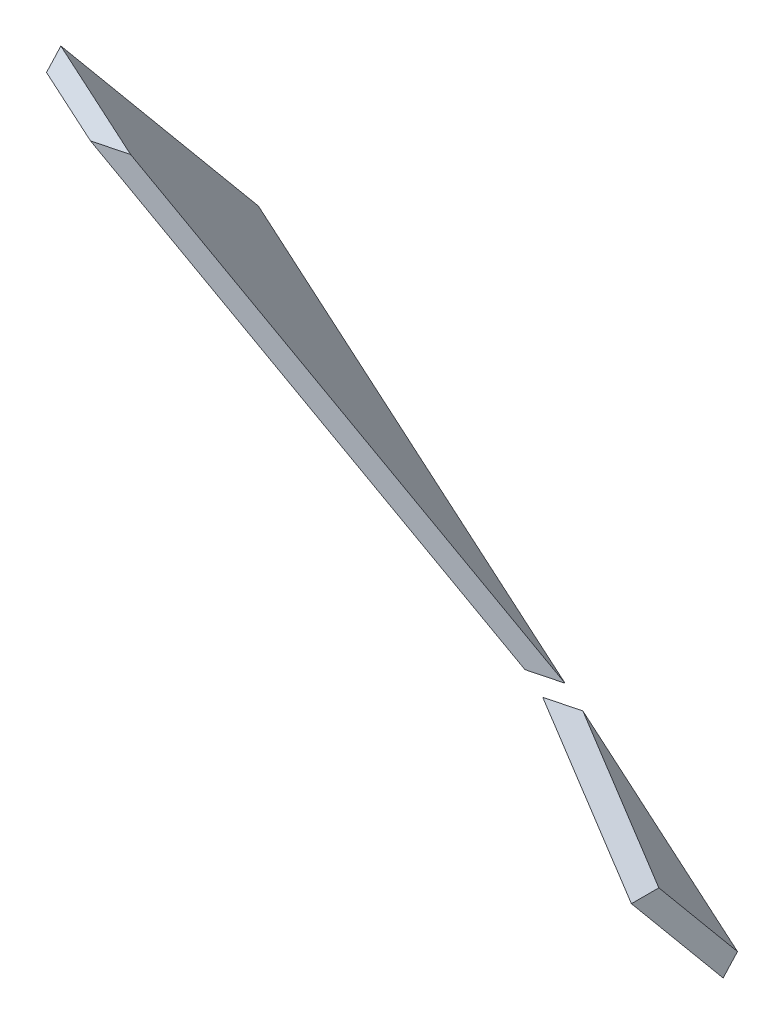
ISO-10303-21;
HEADER;
FILE_DESCRIPTION(('STEP AP214'),'2;1');
FILE_NAME('part.step','',(''),(''),'','','');
FILE_SCHEMA(('AUTOMOTIVE_DESIGN { 1 0 10303 214 1 1 1 1 }'));
ENDSEC;
DATA;
#1=APPLICATION_CONTEXT('core data for automotive mechanical design processes');
#2=APPLICATION_PROTOCOL_DEFINITION('international standard','automotive_design',2000,#1);
#3=PRODUCT_CONTEXT('',#1,'mechanical');
#4=PRODUCT('Part','Part','',(#3));
#5=PRODUCT_RELATED_PRODUCT_CATEGORY('part','',(#4));
#6=PRODUCT_DEFINITION_FORMATION('','',#4);
#7=PRODUCT_DEFINITION_CONTEXT('part definition',#1,'design');
#8=PRODUCT_DEFINITION('design','',#6,#7);
#9=PRODUCT_DEFINITION_SHAPE('','',#8);
#10=(LENGTH_UNIT() NAMED_UNIT(*) SI_UNIT(.MILLI.,.METRE.));
#11=(NAMED_UNIT(*) PLANE_ANGLE_UNIT() SI_UNIT($,.RADIAN.));
#12=(NAMED_UNIT(*) SI_UNIT($,.STERADIAN.) SOLID_ANGLE_UNIT());
#13=UNCERTAINTY_MEASURE_WITH_UNIT(LENGTH_MEASURE(1.E-05),#10,'distance_accuracy_value','');
#14=(GEOMETRIC_REPRESENTATION_CONTEXT(3) GLOBAL_UNCERTAINTY_ASSIGNED_CONTEXT((#13)) GLOBAL_UNIT_ASSIGNED_CONTEXT((#10,
#11,#12)) REPRESENTATION_CONTEXT('',''));
#15=CARTESIAN_POINT('',(0.,0.,0.));
#16=DIRECTION('',(0.,0.,1.));
#17=DIRECTION('',(1.,0.,0.));
#18=AXIS2_PLACEMENT_3D('',#15,#16,#17);
#19=CARTESIAN_POINT('',(71.3837890322314,134.586578544452,53.741586233926));
#20=DIRECTION('',(0.347582620013319,0.627462328708305,-0.696762045691804));
#21=DIRECTION('',(0.,0.743094460928479,0.669186537624161));
#22=AXIS2_PLACEMENT_3D('',#19,#20,#21);
#23=PLANE('',#22);
#24=DIRECTION('',(0.87475293309931,-0.484569196332325,0.));
#25=VECTOR('',#24,1.);
#26=CARTESIAN_POINT('',(50.1004864638517,96.1655821446681,8.52466585722243));
#27=LINE('',#26,#25);
#28=CARTESIAN_POINT('',(-42.1317529525569,147.257611035145,8.52466585722221));
#29=VERTEX_POINT('',#28);
#30=CARTESIAN_POINT('',(26.0556712446343,109.485202286385,8.52466585722238));
#31=VERTEX_POINT('',#30);
#32=EDGE_CURVE('E52',#29,#31,#27,.T.);
#33=ORIENTED_EDGE('',*,*,#32,.F.);
#34=DIRECTION('',(0.924054763186698,-0.10314647424304,0.3680809686512));
#35=VECTOR('',#34,1.);
#36=CARTESIAN_POINT('',(71.3837890322314,134.586578544452,53.741586233926));
#37=LINE('',#36,#35);
#38=CARTESIAN_POINT('',(-53.6065794011068,148.538474397222,3.95387048604648));
#39=VERTEX_POINT('',#38);
#40=EDGE_CURVE('E93',#39,#29,#37,.T.);
#41=ORIENTED_EDGE('',*,*,#40,.F.);
#42=DIRECTION('',(0.159088393343613,-0.771784834590044,-0.615661475325659));
#43=VECTOR('',#42,1.);
#44=CARTESIAN_POINT('',(-53.6065794011068,148.538474397222,3.95387048604648));
#45=LINE('',#44,#43);
#46=CARTESIAN_POINT('',(-47.2430436673622,117.667081013621,-20.6725885269799));
#47=VERTEX_POINT('',#46);
#48=EDGE_CURVE('E97',#39,#47,#45,.T.);
#49=ORIENTED_EDGE('',*,*,#48,.T.);
#50=DIRECTION('',(0.924054763186698,-0.10314647424304,0.3680809686512));
#51=VECTOR('',#50,1.);
#52=CARTESIAN_POINT('',(77.7473247659759,103.71518516085,29.1151272208996));
#53=LINE('',#52,#51);
#54=EDGE_CURVE('E46',#47,#31,#53,.T.);
#55=ORIENTED_EDGE('',*,*,#54,.T.);
#56=EDGE_LOOP('',(#33,#41,#49,#55));
#57=FACE_BOUND('',#56,.T.);
#58=ADVANCED_FACE('F43',(#57),#23,.F.);
#59=CARTESIAN_POINT('',(70.9620757849745,136.632434197047,51.0679577621745));
#60=DIRECTION('',(-0.347582620013319,-0.627462328708305,0.696762045691804));
#61=DIRECTION('',(0.,-0.743094460928479,-0.669186537624161));
#62=AXIS2_PLACEMENT_3D('',#59,#60,#61);
#63=PLANE('',#62);
#64=DIRECTION('',(-0.87475293309931,0.484569196332325,0.));
#65=VECTOR('',#64,1.);
#66=CARTESIAN_POINT('',(50.9372322900048,100.483230502997,8.52466585722243));
#67=LINE('',#66,#65);
#68=CARTESIAN_POINT('',(32.3460114169463,110.781833247175,8.52466585722239));
#69=VERTEX_POINT('',#68);
#70=CARTESIAN_POINT('',(-35.8414127802449,148.554241995936,8.52466585722221));
#71=VERTEX_POINT('',#70);
#72=EDGE_CURVE('E12',#69,#71,#67,.T.);
#73=ORIENTED_EDGE('',*,*,#72,.F.);
#74=DIRECTION('',(-0.924054763186698,0.10314647424304,-0.3680809686512));
#75=VECTOR('',#74,1.);
#76=CARTESIAN_POINT('',(77.325611518719,105.761040813445,26.4414987491482));
#77=LINE('',#76,#75);
#78=CARTESIAN_POINT('',(-47.6647569146267,119.712936666217,-23.3462169987344));
#79=VERTEX_POINT('',#78);
#80=EDGE_CURVE('E91',#69,#79,#77,.T.);
#81=ORIENTED_EDGE('',*,*,#80,.T.);
#82=DIRECTION('',(0.159088393343613,-0.771784834590044,-0.615661475325659));
#83=VECTOR('',#82,1.);
#84=CARTESIAN_POINT('',(-54.0282926483712,150.584330049819,1.28024201429199));
#85=LINE('',#84,#83);
#86=CARTESIAN_POINT('',(-54.0282926483712,150.584330049819,1.28024201429199));
#87=VERTEX_POINT('',#86);
#88=EDGE_CURVE('E102',#87,#79,#85,.T.);
#89=ORIENTED_EDGE('',*,*,#88,.F.);
#90=DIRECTION('',(-0.924054763186698,0.10314647424304,-0.3680809686512));
#91=VECTOR('',#90,1.);
#92=CARTESIAN_POINT('',(70.9620757849745,136.632434197047,51.0679577621745));
#93=LINE('',#92,#91);
#94=EDGE_CURVE('E98',#71,#87,#93,.T.);
#95=ORIENTED_EDGE('',*,*,#94,.F.);
#96=EDGE_LOOP('',(#73,#81,#89,#95));
#97=FACE_BOUND('',#96,.T.);
#98=ADVANCED_FACE('F115',(#97),#63,.F.);
#99=CARTESIAN_POINT('',(-19.9818477788158,96.9378517103248,77.3284186525633));
#100=DIRECTION('',(0.159088393343611,-0.771784834590046,-0.615661475325656));
#101=DIRECTION('',(0.,0.623603475244864,-0.781740817446888));
#102=AXIS2_PLACEMENT_3D('',#99,#100,#101);
#103=PLANE('',#102);
#104=DIRECTION('',(-0.979409013211544,-0.201886068959672,0.));
#105=VECTOR('',#104,1.);
#106=CARTESIAN_POINT('',(-30.8343107600565,149.586358435646,8.52466585722221));
#107=LINE('',#106,#105);
#108=EDGE_CURVE('E80',#71,#29,#107,.T.);
#109=ORIENTED_EDGE('',*,*,#108,.F.);
#110=ORIENTED_EDGE('',*,*,#94,.T.);
#111=DIRECTION('',(0.124293475063408,-0.602984398021064,0.788010753606724));
#112=VECTOR('',#111,1.);
#113=CARTESIAN_POINT('',(-53.6065794011068,148.538474397222,3.95387048604648));
#114=LINE('',#113,#112);
#115=EDGE_CURVE('E104',#87,#39,#114,.T.);
#116=ORIENTED_EDGE('',*,*,#115,.T.);
#117=ORIENTED_EDGE('',*,*,#40,.T.);
#118=EDGE_LOOP('',(#109,#110,#116,#117));
#119=FACE_BOUND('',#118,.T.);
#120=ADVANCED_FACE('F117',(#119),#103,.F.);
#121=CARTESIAN_POINT('',(-13.6183120450713,66.066458326723,52.7019596395369));
#122=DIRECTION('',(0.159088393343611,-0.771784834590046,-0.615661475325656));
#123=DIRECTION('',(0.,0.623603475244864,-0.781740817446888));
#124=AXIS2_PLACEMENT_3D('',#121,#122,#123);
#125=PLANE('',#124);
#126=ORIENTED_EDGE('',*,*,#80,.F.);
#127=DIRECTION('',(-0.979409013211544,-0.201886068959672,0.));
#128=VECTOR('',#127,1.);
#129=CARTESIAN_POINT('',(-20.5864268048876,99.8708433247775,8.52466585722227));
#130=LINE('',#129,#128);
#131=EDGE_CURVE('E79',#69,#31,#130,.T.);
#132=ORIENTED_EDGE('',*,*,#131,.T.);
#133=ORIENTED_EDGE('',*,*,#54,.F.);
#134=DIRECTION('',(0.124293475063408,-0.602984398021064,0.788010753606724));
#135=VECTOR('',#134,1.);
#136=CARTESIAN_POINT('',(-47.2430436673622,117.667081013621,-20.6725885269799));
#137=LINE('',#136,#135);
#138=EDGE_CURVE('E92',#79,#47,#137,.T.);
#139=ORIENTED_EDGE('',*,*,#138,.F.);
#140=EDGE_LOOP('',(#126,#132,#133,#139));
#141=FACE_BOUND('',#140,.T.);
#142=ADVANCED_FACE('F89',(#141),#125,.T.);
#143=CARTESIAN_POINT('',(-53.6065794011068,148.538474397222,3.95387048604648));
#144=DIRECTION('',(0.979409013211544,0.201886068959674,0.));
#145=DIRECTION('',(-0.201886068959674,0.979409013211544,0.));
#146=AXIS2_PLACEMENT_3D('',#143,#144,#145);
#147=PLANE('',#146);
#148=ORIENTED_EDGE('',*,*,#138,.T.);
#149=ORIENTED_EDGE('',*,*,#48,.F.);
#150=ORIENTED_EDGE('',*,*,#115,.F.);
#151=ORIENTED_EDGE('',*,*,#88,.T.);
#152=EDGE_LOOP('',(#148,#149,#150,#151));
#153=FACE_BOUND('',#152,.T.);
#154=ADVANCED_FACE('F112',(#153),#147,.F.);
#155=CARTESIAN_POINT('',(-62.7420578499538,148.788157277611,8.52466585722215));
#156=DIRECTION('',(0.,0.,1.));
#157=DIRECTION('',(1.,0.,0.));
#158=AXIS2_PLACEMENT_3D('',#155,#156,#157);
#159=PLANE('',#158);
#160=ORIENTED_EDGE('',*,*,#108,.T.);
#161=ORIENTED_EDGE('',*,*,#32,.T.);
#162=ORIENTED_EDGE('',*,*,#131,.F.);
#163=ORIENTED_EDGE('',*,*,#72,.T.);
#164=EDGE_LOOP('',(#160,#161,#162,#163));
#165=FACE_BOUND('',#164,.T.);
#166=ADVANCED_FACE('F78',(#165),#159,.T.);
#167=CLOSED_SHELL('',(#58,#98,#120,#142,#154,#166));
#168=MANIFOLD_SOLID_BREP('B2',#167);
#169=CARTESIAN_POINT('',(-13.6183120450713,66.066458326723,52.7019596395369));
#170=DIRECTION('',(0.159088393343611,-0.771784834590046,-0.615661475325656));
#171=DIRECTION('',(0.,0.623603475244864,-0.781740817446888));
#172=AXIS2_PLACEMENT_3D('',#169,#170,#171);
#173=PLANE('',#172);
#174=DIRECTION('',(-0.979409013211543,-0.201886068959676,0.));
#175=VECTOR('',#174,1.);
#176=CARTESIAN_POINT('',(-20.2951006882811,98.4575341952326,10.371650283199));
#177=LINE('',#176,#175);
#178=CARTESIAN_POINT('',(36.9828030517034,110.264257094788,10.3716502831988));
#179=VERTEX_POINT('',#178);
#180=CARTESIAN_POINT('',(30.6924628793914,108.967626133998,10.3716502831988));
#181=VERTEX_POINT('',#180);
#182=EDGE_CURVE('E41',#179,#181,#177,.T.);
#183=ORIENTED_EDGE('',*,*,#182,.F.);
#184=DIRECTION('',(-0.924054763186698,0.10314647424304,-0.3680809686512));
#185=VECTOR('',#184,1.);
#186=CARTESIAN_POINT('',(77.325611518719,105.761040813445,26.4414987491482));
#187=LINE('',#186,#185);
#188=CARTESIAN_POINT('',(77.325611518719,105.761040813445,26.4414987491482));
#189=VERTEX_POINT('',#188);
#190=EDGE_CURVE('E215',#189,#179,#187,.T.);
#191=ORIENTED_EDGE('',*,*,#190,.F.);
#192=DIRECTION('',(-0.124293475061318,0.602984398021498,-0.788010753606722));
#193=VECTOR('',#192,1.);
#194=CARTESIAN_POINT('',(77.7473247659759,103.71518516085,29.1151272208996));
#195=LINE('',#194,#193);
#196=CARTESIAN_POINT('',(77.7473247659759,103.71518516085,29.1151272208996));
#197=VERTEX_POINT('',#196);
#198=EDGE_CURVE('E213',#197,#189,#195,.T.);
#199=ORIENTED_EDGE('',*,*,#198,.F.);
#200=DIRECTION('',(0.924054763186698,-0.10314647424304,0.3680809686512));
#201=VECTOR('',#200,1.);
#202=CARTESIAN_POINT('',(77.7473247659759,103.71518516085,29.1151272208996));
#203=LINE('',#202,#201);
#204=EDGE_CURVE('E209',#181,#197,#203,.T.);
#205=ORIENTED_EDGE('',*,*,#204,.F.);
#206=EDGE_LOOP('',(#183,#191,#199,#205));
#207=FACE_BOUND('',#206,.T.);
#208=ADVANCED_FACE('F167',(#207),#173,.T.);
#209=CARTESIAN_POINT('',(70.9620757849745,136.632434197047,51.0679577621745));
#210=DIRECTION('',(-0.347582620013319,-0.627462328708305,0.696762045691804));
#211=DIRECTION('',(0.,-0.743094460928479,-0.669186537624161));
#212=AXIS2_PLACEMENT_3D('',#209,#210,#211);
#213=PLANE('',#212);
#214=ORIENTED_EDGE('',*,*,#190,.T.);
#215=DIRECTION('',(0.81351732338333,0.167690732097627,0.556838740501938));
#216=VECTOR('',#215,1.);
#217=CARTESIAN_POINT('',(81.5031133454138,119.441250886779,40.845043778501));
#218=LINE('',#217,#216);
#219=CARTESIAN_POINT('',(74.7909033304953,118.057659684672,36.250650440757));
#220=VERTEX_POINT('',#219);
#221=EDGE_CURVE('E181',#179,#220,#218,.T.);
#222=ORIENTED_EDGE('',*,*,#221,.T.);
#223=DIRECTION('',(0.159088393343613,-0.771784834590044,-0.615661475325659));
#224=VECTOR('',#223,1.);
#225=CARTESIAN_POINT('',(70.9620757849745,136.632434197047,51.0679577621745));
#226=LINE('',#225,#224);
#227=EDGE_CURVE('E188',#220,#189,#226,.T.);
#228=ORIENTED_EDGE('',*,*,#227,.T.);
#229=EDGE_LOOP('',(#214,#222,#228));
#230=FACE_BOUND('',#229,.T.);
#231=ADVANCED_FACE('F223',(#230),#213,.F.);
#232=CARTESIAN_POINT('',(71.3837890322314,134.586578544452,53.741586233926));
#233=DIRECTION('',(-0.979409013211809,-0.201886068958387,-1.68480680795557E-12));
#234=DIRECTION('',(0.201886068958387,-0.979409013211809,0.));
#235=AXIS2_PLACEMENT_3D('',#232,#233,#234);
#236=PLANE('',#235);
#237=ORIENTED_EDGE('',*,*,#227,.F.);
#238=DIRECTION('',(-1.65028867508921E-12,-3.39296344345331E-13,1.));
#239=VECTOR('',#238,1.);
#240=CARTESIAN_POINT('',(74.7909033304664,118.057659684667,53.741586233926));
#241=LINE('',#240,#239);
#242=CARTESIAN_POINT('',(74.7909033304882,118.057659684671,40.5562810624967));
#243=VERTEX_POINT('',#242);
#244=EDGE_CURVE('E211',#220,#243,#241,.T.);
#245=ORIENTED_EDGE('',*,*,#244,.T.);
#246=DIRECTION('',(0.159088393343613,-0.771784834590044,-0.615661475325659));
#247=VECTOR('',#246,1.);
#248=CARTESIAN_POINT('',(71.3837890322314,134.586578544452,53.741586233926));
#249=LINE('',#248,#247);
#250=EDGE_CURVE('E175',#243,#197,#249,.T.);
#251=ORIENTED_EDGE('',*,*,#250,.T.);
#252=ORIENTED_EDGE('',*,*,#198,.T.);
#253=EDGE_LOOP('',(#237,#245,#251,#252));
#254=FACE_BOUND('',#253,.T.);
#255=ADVANCED_FACE('F221',(#254),#236,.F.);
#256=CARTESIAN_POINT('',(71.3837890322314,134.586578544452,53.741586233926));
#257=DIRECTION('',(0.347582620013319,0.627462328708305,-0.696762045691804));
#258=DIRECTION('',(0.,0.743094460928479,0.669186537624161));
#259=AXIS2_PLACEMENT_3D('',#256,#257,#258);
#260=PLANE('',#259);
#261=ORIENTED_EDGE('',*,*,#250,.F.);
#262=DIRECTION('',(-0.81351732338333,-0.167690732097627,-0.556838740501938));
#263=VECTOR('',#262,1.);
#264=CARTESIAN_POINT('',(80.7638196979242,119.288859918057,44.6446405006635));
#265=LINE('',#264,#263);
#266=EDGE_CURVE('E201',#243,#181,#265,.T.);
#267=ORIENTED_EDGE('',*,*,#266,.T.);
#268=ORIENTED_EDGE('',*,*,#204,.T.);
#269=EDGE_LOOP('',(#261,#267,#268));
#270=FACE_BOUND('',#269,.T.);
#271=ADVANCED_FACE('F169',(#270),#260,.F.);
#272=CARTESIAN_POINT('',(-20.2951006882811,98.4575341952326,0.));
#273=DIRECTION('',(0.201886068959676,-0.979409013211543,0.));
#274=DIRECTION('',(0.979409013211543,0.201886068959676,0.));
#275=AXIS2_PLACEMENT_3D('',#272,#273,#274);
#276=PLANE('',#275);
#277=ORIENTED_EDGE('',*,*,#244,.F.);
#278=ORIENTED_EDGE('',*,*,#221,.F.);
#279=ORIENTED_EDGE('',*,*,#182,.T.);
#280=ORIENTED_EDGE('',*,*,#266,.F.);
#281=EDGE_LOOP('',(#277,#278,#279,#280));
#282=FACE_BOUND('',#281,.T.);
#283=ADVANCED_FACE('F200',(#282),#276,.F.);
#284=CLOSED_SHELL('',(#208,#231,#255,#271,#283));
#285=MANIFOLD_SOLID_BREP('B6',#284);
#286=ADVANCED_BREP_SHAPE_REPRESENTATION('',(#18,#168,#285),#14);
#287=SHAPE_DEFINITION_REPRESENTATION(#9,#286);
ENDSEC;
END-ISO-10303-21;
